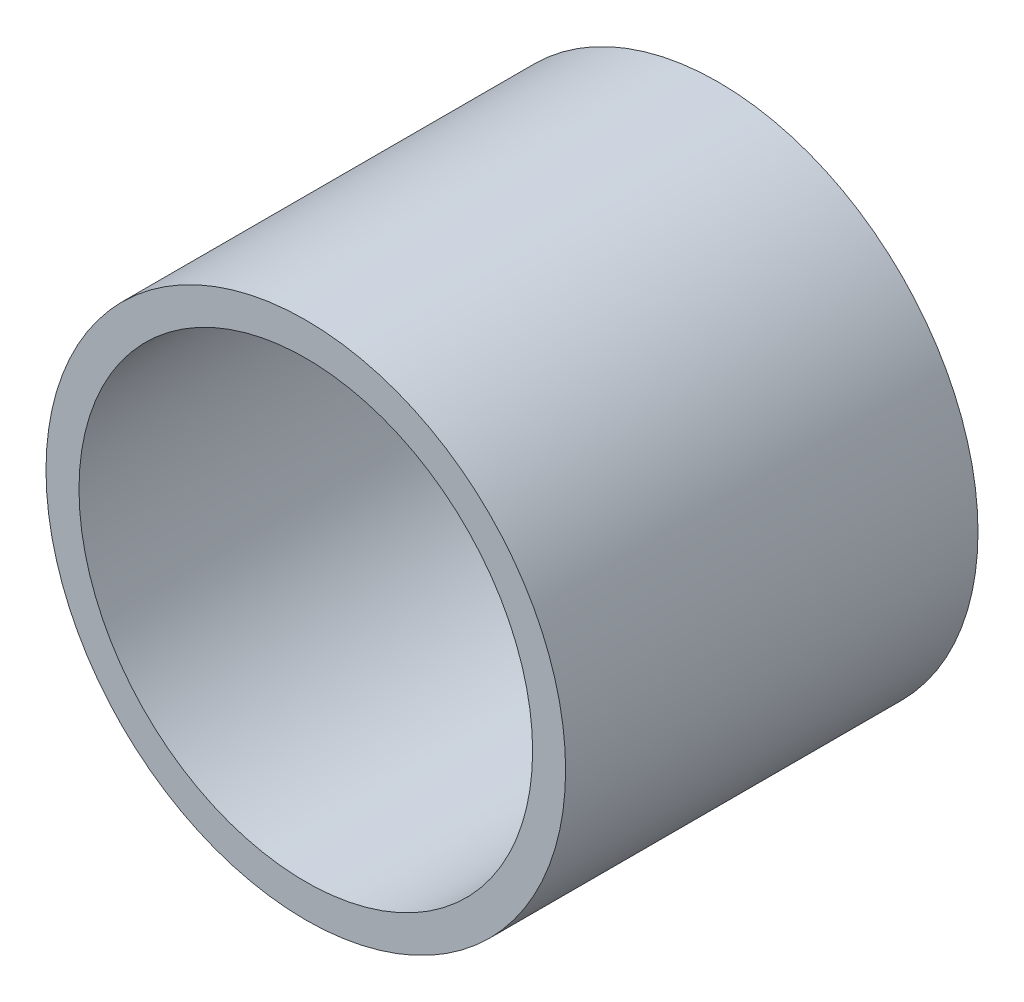
ISO-10303-21;
HEADER;
FILE_DESCRIPTION(('STEP AP214'),'2;1');
FILE_NAME('part.step','',(''),(''),'','','');
FILE_SCHEMA(('AUTOMOTIVE_DESIGN { 1 0 10303 214 1 1 1 1 }'));
ENDSEC;
DATA;
#1=APPLICATION_CONTEXT('core data for automotive mechanical design processes');
#2=APPLICATION_PROTOCOL_DEFINITION('international standard','automotive_design',2000,#1);
#3=PRODUCT_CONTEXT('',#1,'mechanical');
#4=PRODUCT('Part','Part','',(#3));
#5=PRODUCT_RELATED_PRODUCT_CATEGORY('part','',(#4));
#6=PRODUCT_DEFINITION_FORMATION('','',#4);
#7=PRODUCT_DEFINITION_CONTEXT('part definition',#1,'design');
#8=PRODUCT_DEFINITION('design','',#6,#7);
#9=PRODUCT_DEFINITION_SHAPE('','',#8);
#10=(LENGTH_UNIT() NAMED_UNIT(*) SI_UNIT(.MILLI.,.METRE.));
#11=(NAMED_UNIT(*) PLANE_ANGLE_UNIT() SI_UNIT($,.RADIAN.));
#12=(NAMED_UNIT(*) SI_UNIT($,.STERADIAN.) SOLID_ANGLE_UNIT());
#13=UNCERTAINTY_MEASURE_WITH_UNIT(LENGTH_MEASURE(1.E-05),#10,'distance_accuracy_value','');
#14=(GEOMETRIC_REPRESENTATION_CONTEXT(3) GLOBAL_UNCERTAINTY_ASSIGNED_CONTEXT((#13)) GLOBAL_UNIT_ASSIGNED_CONTEXT((#10,
#11,#12)) REPRESENTATION_CONTEXT('',''));
#15=CARTESIAN_POINT('',(0.,0.,0.));
#16=DIRECTION('',(0.,0.,1.));
#17=DIRECTION('',(1.,0.,0.));
#18=AXIS2_PLACEMENT_3D('',#15,#16,#17);
#19=CARTESIAN_POINT('',(0.,0.,50.));
#20=DIRECTION('',(0.,0.,1.));
#21=DIRECTION('',(1.,0.,0.));
#22=AXIS2_PLACEMENT_3D('',#19,#20,#21);
#23=PLANE('',#22);
#24=CARTESIAN_POINT('',(0.,0.,50.));
#25=DIRECTION('',(0.,0.,1.));
#26=DIRECTION('',(1.,0.,0.));
#27=AXIS2_PLACEMENT_3D('',#24,#25,#26);
#28=CIRCLE('',#27,31.5);
#29=CARTESIAN_POINT('',(31.5,0.,50.));
#30=VERTEX_POINT('',#29);
#31=EDGE_CURVE('E10',#30,#30,#28,.T.);
#32=ORIENTED_EDGE('',*,*,#31,.T.);
#33=EDGE_LOOP('',(#32));
#34=FACE_BOUND('',#33,.T.);
#35=CARTESIAN_POINT('',(0.,0.,50.));
#36=DIRECTION('',(0.,0.,1.));
#37=DIRECTION('',(1.,0.,0.));
#38=AXIS2_PLACEMENT_3D('',#35,#36,#37);
#39=CIRCLE('',#38,27.5);
#40=CARTESIAN_POINT('',(27.5,0.,50.));
#41=VERTEX_POINT('',#40);
#42=EDGE_CURVE('E50',#41,#41,#39,.T.);
#43=ORIENTED_EDGE('',*,*,#42,.F.);
#44=EDGE_LOOP('',(#43));
#45=FACE_BOUND('',#44,.T.);
#46=ADVANCED_FACE('F37',(#34,#45),#23,.T.);
#47=CARTESIAN_POINT('',(0.,0.,0.));
#48=DIRECTION('',(0.,0.,1.));
#49=DIRECTION('',(1.,0.,0.));
#50=AXIS2_PLACEMENT_3D('',#47,#48,#49);
#51=PLANE('',#50);
#52=CARTESIAN_POINT('',(0.,0.,0.));
#53=DIRECTION('',(0.,0.,1.));
#54=DIRECTION('',(1.,0.,0.));
#55=AXIS2_PLACEMENT_3D('',#52,#53,#54);
#56=CIRCLE('',#55,31.5);
#57=CARTESIAN_POINT('',(31.5,0.,0.));
#58=VERTEX_POINT('',#57);
#59=EDGE_CURVE('E41',#58,#58,#56,.T.);
#60=ORIENTED_EDGE('',*,*,#59,.F.);
#61=EDGE_LOOP('',(#60));
#62=FACE_BOUND('',#61,.T.);
#63=CARTESIAN_POINT('',(0.,0.,0.));
#64=DIRECTION('',(0.,0.,1.));
#65=DIRECTION('',(1.,0.,0.));
#66=AXIS2_PLACEMENT_3D('',#63,#64,#65);
#67=CIRCLE('',#66,27.5);
#68=CARTESIAN_POINT('',(27.5,0.,0.));
#69=VERTEX_POINT('',#68);
#70=EDGE_CURVE('E52',#69,#69,#67,.T.);
#71=ORIENTED_EDGE('',*,*,#70,.T.);
#72=EDGE_LOOP('',(#71));
#73=FACE_BOUND('',#72,.T.);
#74=ADVANCED_FACE('F64',(#62,#73),#51,.F.);
#75=CARTESIAN_POINT('',(0.,0.,50.));
#76=DIRECTION('',(0.,0.,-1.));
#77=DIRECTION('',(-1.,0.,0.));
#78=AXIS2_PLACEMENT_3D('',#75,#76,#77);
#79=CYLINDRICAL_SURFACE('',#78,31.5);
#80=ORIENTED_EDGE('',*,*,#31,.F.);
#81=EDGE_LOOP('',(#80));
#82=FACE_BOUND('',#81,.T.);
#83=ORIENTED_EDGE('',*,*,#59,.T.);
#84=EDGE_LOOP('',(#83));
#85=FACE_BOUND('',#84,.T.);
#86=ADVANCED_FACE('F39',(#82,#85),#79,.T.);
#87=CARTESIAN_POINT('',(0.,0.,50.));
#88=DIRECTION('',(0.,0.,-1.));
#89=DIRECTION('',(-1.,0.,0.));
#90=AXIS2_PLACEMENT_3D('',#87,#88,#89);
#91=CYLINDRICAL_SURFACE('',#90,27.5);
#92=ORIENTED_EDGE('',*,*,#42,.T.);
#93=EDGE_LOOP('',(#92));
#94=FACE_BOUND('',#93,.T.);
#95=ORIENTED_EDGE('',*,*,#70,.F.);
#96=EDGE_LOOP('',(#95));
#97=FACE_BOUND('',#96,.T.);
#98=ADVANCED_FACE('F60',(#94,#97),#91,.F.);
#99=CLOSED_SHELL('',(#46,#74,#86,#98));
#100=MANIFOLD_SOLID_BREP('B2',#99);
#101=ADVANCED_BREP_SHAPE_REPRESENTATION('',(#18,#100),#14);
#102=SHAPE_DEFINITION_REPRESENTATION(#9,#101);
ENDSEC;
END-ISO-10303-21;
